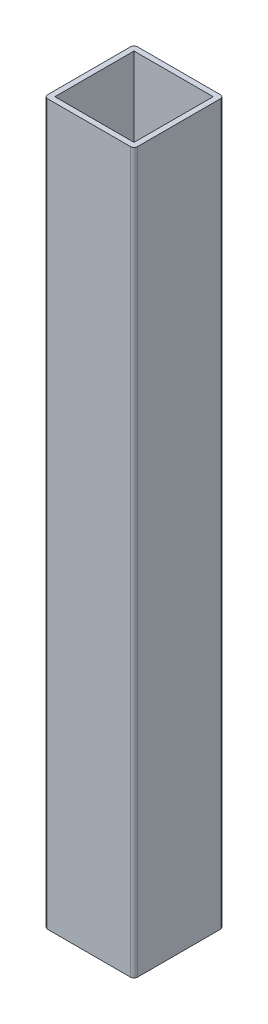
ISO-10303-21;
HEADER;
FILE_DESCRIPTION(('STEP AP214'),'2;1');
FILE_NAME('part.step','',(''),(''),'','','');
FILE_SCHEMA(('AUTOMOTIVE_DESIGN { 1 0 10303 214 1 1 1 1 }'));
ENDSEC;
DATA;
#1=APPLICATION_CONTEXT('core data for automotive mechanical design processes');
#2=APPLICATION_PROTOCOL_DEFINITION('international standard','automotive_design',2000,#1);
#3=PRODUCT_CONTEXT('',#1,'mechanical');
#4=PRODUCT('Part','Part','',(#3));
#5=PRODUCT_RELATED_PRODUCT_CATEGORY('part','',(#4));
#6=PRODUCT_DEFINITION_FORMATION('','',#4);
#7=PRODUCT_DEFINITION_CONTEXT('part definition',#1,'design');
#8=PRODUCT_DEFINITION('design','',#6,#7);
#9=PRODUCT_DEFINITION_SHAPE('','',#8);
#10=(LENGTH_UNIT() NAMED_UNIT(*) SI_UNIT(.MILLI.,.METRE.));
#11=(NAMED_UNIT(*) PLANE_ANGLE_UNIT() SI_UNIT($,.RADIAN.));
#12=(NAMED_UNIT(*) SI_UNIT($,.STERADIAN.) SOLID_ANGLE_UNIT());
#13=UNCERTAINTY_MEASURE_WITH_UNIT(LENGTH_MEASURE(1.E-05),#10,'distance_accuracy_value','');
#14=(GEOMETRIC_REPRESENTATION_CONTEXT(3) GLOBAL_UNCERTAINTY_ASSIGNED_CONTEXT((#13)) GLOBAL_UNIT_ASSIGNED_CONTEXT((#10,
#11,#12)) REPRESENTATION_CONTEXT('',''));
#15=CARTESIAN_POINT('',(0.,0.,0.));
#16=DIRECTION('',(0.,0.,1.));
#17=DIRECTION('',(1.,0.,0.));
#18=AXIS2_PLACEMENT_3D('',#15,#16,#17);
#19=CARTESIAN_POINT('',(2.,400.,-2.));
#20=DIRECTION('',(0.,-1.,0.));
#21=DIRECTION('',(0.,0.,-1.));
#22=AXIS2_PLACEMENT_3D('',#19,#20,#21);
#23=PLANE('',#22);
#24=CARTESIAN_POINT('',(2.,400.,-2.));
#25=DIRECTION('',(0.,1.,0.));
#26=DIRECTION('',(0.,0.,-1.));
#27=AXIS2_PLACEMENT_3D('',#24,#25,#26);
#28=CIRCLE('',#27,2.);
#29=CARTESIAN_POINT('',(0.,400.,-2.00000000000001));
#30=VERTEX_POINT('',#29);
#31=CARTESIAN_POINT('',(2.00000000000001,400.,0.));
#32=VERTEX_POINT('',#31);
#33=EDGE_CURVE('E181',#30,#32,#28,.T.);
#34=ORIENTED_EDGE('',*,*,#33,.T.);
#35=DIRECTION('',(1.,0.,0.));
#36=VECTOR('',#35,1.);
#37=CARTESIAN_POINT('',(2.00000000000001,400.,0.));
#38=LINE('',#37,#36);
#39=CARTESIAN_POINT('',(48.,400.,0.));
#40=VERTEX_POINT('',#39);
#41=EDGE_CURVE('E185',#32,#40,#38,.T.);
#42=ORIENTED_EDGE('',*,*,#41,.T.);
#43=CARTESIAN_POINT('',(48.,400.,-2.));
#44=DIRECTION('',(0.,1.,0.));
#45=DIRECTION('',(0.,0.,1.));
#46=AXIS2_PLACEMENT_3D('',#43,#44,#45);
#47=CIRCLE('',#46,2.);
#48=CARTESIAN_POINT('',(50.,400.,-2.00000000000001));
#49=VERTEX_POINT('',#48);
#50=EDGE_CURVE('E189',#40,#49,#47,.T.);
#51=ORIENTED_EDGE('',*,*,#50,.T.);
#52=DIRECTION('',(0.,0.,-1.));
#53=VECTOR('',#52,1.);
#54=CARTESIAN_POINT('',(50.,400.,-2.00000000000001));
#55=LINE('',#54,#53);
#56=CARTESIAN_POINT('',(50.,400.,-48.));
#57=VERTEX_POINT('',#56);
#58=EDGE_CURVE('E192',#49,#57,#55,.T.);
#59=ORIENTED_EDGE('',*,*,#58,.T.);
#60=CARTESIAN_POINT('',(48.,400.,-48.));
#61=DIRECTION('',(0.,1.,0.));
#62=DIRECTION('',(0.,0.,-1.));
#63=AXIS2_PLACEMENT_3D('',#60,#61,#62);
#64=CIRCLE('',#63,2.);
#65=CARTESIAN_POINT('',(48.,400.,-50.));
#66=VERTEX_POINT('',#65);
#67=EDGE_CURVE('E195',#57,#66,#64,.T.);
#68=ORIENTED_EDGE('',*,*,#67,.T.);
#69=DIRECTION('',(-1.,0.,0.));
#70=VECTOR('',#69,1.);
#71=CARTESIAN_POINT('',(2.00000000000001,400.,-50.));
#72=LINE('',#71,#70);
#73=CARTESIAN_POINT('',(2.00000000000001,400.,-50.));
#74=VERTEX_POINT('',#73);
#75=EDGE_CURVE('E198',#66,#74,#72,.T.);
#76=ORIENTED_EDGE('',*,*,#75,.T.);
#77=CARTESIAN_POINT('',(2.,400.,-48.));
#78=DIRECTION('',(0.,1.,0.));
#79=DIRECTION('',(0.,0.,-1.));
#80=AXIS2_PLACEMENT_3D('',#77,#78,#79);
#81=CIRCLE('',#80,2.);
#82=CARTESIAN_POINT('',(0.,400.,-48.));
#83=VERTEX_POINT('',#82);
#84=EDGE_CURVE('E201',#74,#83,#81,.T.);
#85=ORIENTED_EDGE('',*,*,#84,.T.);
#86=DIRECTION('',(0.,0.,1.));
#87=VECTOR('',#86,1.);
#88=CARTESIAN_POINT('',(0.,400.,-2.00000000000001));
#89=LINE('',#88,#87);
#90=EDGE_CURVE('E204',#83,#30,#89,.T.);
#91=ORIENTED_EDGE('',*,*,#90,.T.);
#92=EDGE_LOOP('',(#34,#42,#51,#59,#68,#76,#85,#91));
#93=FACE_BOUND('',#92,.T.);
#94=DIRECTION('',(0.,0.,1.));
#95=VECTOR('',#94,1.);
#96=CARTESIAN_POINT('',(3.,400.,-3.));
#97=LINE('',#96,#95);
#98=CARTESIAN_POINT('',(3.,400.,-47.));
#99=VERTEX_POINT('',#98);
#100=CARTESIAN_POINT('',(3.,400.,-3.));
#101=VERTEX_POINT('',#100);
#102=EDGE_CURVE('E133',#99,#101,#97,.T.);
#103=ORIENTED_EDGE('',*,*,#102,.F.);
#104=DIRECTION('',(-1.,0.,0.));
#105=VECTOR('',#104,1.);
#106=CARTESIAN_POINT('',(3.,400.,-47.));
#107=LINE('',#106,#105);
#108=CARTESIAN_POINT('',(47.,400.,-47.));
#109=VERTEX_POINT('',#108);
#110=EDGE_CURVE('E159',#109,#99,#107,.T.);
#111=ORIENTED_EDGE('',*,*,#110,.F.);
#112=DIRECTION('',(0.,0.,-1.));
#113=VECTOR('',#112,1.);
#114=CARTESIAN_POINT('',(47.,400.,-3.));
#115=LINE('',#114,#113);
#116=CARTESIAN_POINT('',(47.,400.,-3.));
#117=VERTEX_POINT('',#116);
#118=EDGE_CURVE('E155',#117,#109,#115,.T.);
#119=ORIENTED_EDGE('',*,*,#118,.F.);
#120=DIRECTION('',(1.,0.,0.));
#121=VECTOR('',#120,1.);
#122=CARTESIAN_POINT('',(3.,400.,-3.));
#123=LINE('',#122,#121);
#124=EDGE_CURVE('E142',#101,#117,#123,.T.);
#125=ORIENTED_EDGE('',*,*,#124,.F.);
#126=EDGE_LOOP('',(#103,#111,#119,#125));
#127=FACE_BOUND('',#126,.T.);
#128=ADVANCED_FACE('F43',(#93,#127),#23,.F.);
#129=CARTESIAN_POINT('',(2.,0.,-2.));
#130=DIRECTION('',(0.,-1.,0.));
#131=DIRECTION('',(0.,0.,-1.));
#132=AXIS2_PLACEMENT_3D('',#129,#130,#131);
#133=PLANE('',#132);
#134=CARTESIAN_POINT('',(2.,0.,-2.));
#135=DIRECTION('',(0.,1.,0.));
#136=DIRECTION('',(0.,0.,-1.));
#137=AXIS2_PLACEMENT_3D('',#134,#135,#136);
#138=CIRCLE('',#137,2.);
#139=CARTESIAN_POINT('',(0.,0.,-2.00000000000001));
#140=VERTEX_POINT('',#139);
#141=CARTESIAN_POINT('',(2.00000000000001,0.,0.));
#142=VERTEX_POINT('',#141);
#143=EDGE_CURVE('E151',#140,#142,#138,.T.);
#144=ORIENTED_EDGE('',*,*,#143,.F.);
#145=DIRECTION('',(0.,0.,1.));
#146=VECTOR('',#145,1.);
#147=CARTESIAN_POINT('',(0.,0.,-2.00000000000001));
#148=LINE('',#147,#146);
#149=CARTESIAN_POINT('',(0.,0.,-48.));
#150=VERTEX_POINT('',#149);
#151=EDGE_CURVE('E186',#150,#140,#148,.T.);
#152=ORIENTED_EDGE('',*,*,#151,.F.);
#153=CARTESIAN_POINT('',(2.,0.,-48.));
#154=DIRECTION('',(0.,1.,0.));
#155=DIRECTION('',(0.,0.,-1.));
#156=AXIS2_PLACEMENT_3D('',#153,#154,#155);
#157=CIRCLE('',#156,2.);
#158=CARTESIAN_POINT('',(2.00000000000001,0.,-50.));
#159=VERTEX_POINT('',#158);
#160=EDGE_CURVE('E226',#159,#150,#157,.T.);
#161=ORIENTED_EDGE('',*,*,#160,.F.);
#162=DIRECTION('',(-1.,0.,0.));
#163=VECTOR('',#162,1.);
#164=CARTESIAN_POINT('',(2.00000000000001,0.,-50.));
#165=LINE('',#164,#163);
#166=CARTESIAN_POINT('',(48.,0.,-50.));
#167=VERTEX_POINT('',#166);
#168=EDGE_CURVE('E223',#167,#159,#165,.T.);
#169=ORIENTED_EDGE('',*,*,#168,.F.);
#170=CARTESIAN_POINT('',(48.,0.,-48.));
#171=DIRECTION('',(0.,1.,0.));
#172=DIRECTION('',(0.,0.,-1.));
#173=AXIS2_PLACEMENT_3D('',#170,#171,#172);
#174=CIRCLE('',#173,2.);
#175=CARTESIAN_POINT('',(50.,0.,-48.));
#176=VERTEX_POINT('',#175);
#177=EDGE_CURVE('E220',#176,#167,#174,.T.);
#178=ORIENTED_EDGE('',*,*,#177,.F.);
#179=DIRECTION('',(0.,0.,-1.));
#180=VECTOR('',#179,1.);
#181=CARTESIAN_POINT('',(50.,0.,-2.00000000000001));
#182=LINE('',#181,#180);
#183=CARTESIAN_POINT('',(50.,0.,-2.00000000000001));
#184=VERTEX_POINT('',#183);
#185=EDGE_CURVE('E217',#184,#176,#182,.T.);
#186=ORIENTED_EDGE('',*,*,#185,.F.);
#187=CARTESIAN_POINT('',(48.,0.,-2.));
#188=DIRECTION('',(0.,1.,0.));
#189=DIRECTION('',(0.,0.,1.));
#190=AXIS2_PLACEMENT_3D('',#187,#188,#189);
#191=CIRCLE('',#190,2.);
#192=CARTESIAN_POINT('',(48.,0.,0.));
#193=VERTEX_POINT('',#192);
#194=EDGE_CURVE('E214',#193,#184,#191,.T.);
#195=ORIENTED_EDGE('',*,*,#194,.F.);
#196=DIRECTION('',(1.,0.,0.));
#197=VECTOR('',#196,1.);
#198=CARTESIAN_POINT('',(2.00000000000001,0.,0.));
#199=LINE('',#198,#197);
#200=EDGE_CURVE('E211',#142,#193,#199,.T.);
#201=ORIENTED_EDGE('',*,*,#200,.F.);
#202=EDGE_LOOP('',(#144,#152,#161,#169,#178,#186,#195,#201));
#203=FACE_BOUND('',#202,.T.);
#204=DIRECTION('',(-1.,0.,0.));
#205=VECTOR('',#204,1.);
#206=CARTESIAN_POINT('',(3.,0.,-47.));
#207=LINE('',#206,#205);
#208=CARTESIAN_POINT('',(47.,0.,-47.));
#209=VERTEX_POINT('',#208);
#210=CARTESIAN_POINT('',(3.,0.,-47.));
#211=VERTEX_POINT('',#210);
#212=EDGE_CURVE('E143',#209,#211,#207,.T.);
#213=ORIENTED_EDGE('',*,*,#212,.T.);
#214=DIRECTION('',(0.,0.,1.));
#215=VECTOR('',#214,1.);
#216=CARTESIAN_POINT('',(3.,0.,-3.));
#217=LINE('',#216,#215);
#218=CARTESIAN_POINT('',(3.,0.,-3.));
#219=VERTEX_POINT('',#218);
#220=EDGE_CURVE('E67',#211,#219,#217,.T.);
#221=ORIENTED_EDGE('',*,*,#220,.T.);
#222=DIRECTION('',(1.,0.,0.));
#223=VECTOR('',#222,1.);
#224=CARTESIAN_POINT('',(3.,0.,-3.));
#225=LINE('',#224,#223);
#226=CARTESIAN_POINT('',(47.,0.,-3.));
#227=VERTEX_POINT('',#226);
#228=EDGE_CURVE('E149',#219,#227,#225,.T.);
#229=ORIENTED_EDGE('',*,*,#228,.T.);
#230=DIRECTION('',(0.,0.,-1.));
#231=VECTOR('',#230,1.);
#232=CARTESIAN_POINT('',(47.,0.,-3.));
#233=LINE('',#232,#231);
#234=EDGE_CURVE('E168',#227,#209,#233,.T.);
#235=ORIENTED_EDGE('',*,*,#234,.T.);
#236=EDGE_LOOP('',(#213,#221,#229,#235));
#237=FACE_BOUND('',#236,.T.);
#238=ADVANCED_FACE('F265',(#203,#237),#133,.T.);
#239=CARTESIAN_POINT('',(2.,400.,-2.));
#240=DIRECTION('',(0.,-1.,0.));
#241=DIRECTION('',(0.,0.,-1.));
#242=AXIS2_PLACEMENT_3D('',#239,#240,#241);
#243=CYLINDRICAL_SURFACE('',#242,2.);
#244=ORIENTED_EDGE('',*,*,#143,.T.);
#245=DIRECTION('',(0.,-1.,0.));
#246=VECTOR('',#245,1.);
#247=CARTESIAN_POINT('',(2.00000000000001,400.,0.));
#248=LINE('',#247,#246);
#249=EDGE_CURVE('E11',#32,#142,#248,.T.);
#250=ORIENTED_EDGE('',*,*,#249,.F.);
#251=ORIENTED_EDGE('',*,*,#33,.F.);
#252=DIRECTION('',(0.,-1.,0.));
#253=VECTOR('',#252,1.);
#254=CARTESIAN_POINT('',(0.,400.,-2.00000000000001));
#255=LINE('',#254,#253);
#256=EDGE_CURVE('E207',#30,#140,#255,.T.);
#257=ORIENTED_EDGE('',*,*,#256,.T.);
#258=EDGE_LOOP('',(#244,#250,#251,#257));
#259=FACE_BOUND('',#258,.T.);
#260=ADVANCED_FACE('F45',(#259),#243,.T.);
#261=CARTESIAN_POINT('',(2.00000000000001,400.,0.));
#262=DIRECTION('',(0.,0.,-1.));
#263=DIRECTION('',(-1.,0.,0.));
#264=AXIS2_PLACEMENT_3D('',#261,#262,#263);
#265=PLANE('',#264);
#266=ORIENTED_EDGE('',*,*,#200,.T.);
#267=DIRECTION('',(0.,-1.,0.));
#268=VECTOR('',#267,1.);
#269=CARTESIAN_POINT('',(48.,400.,0.));
#270=LINE('',#269,#268);
#271=EDGE_CURVE('E52',#40,#193,#270,.T.);
#272=ORIENTED_EDGE('',*,*,#271,.F.);
#273=ORIENTED_EDGE('',*,*,#41,.F.);
#274=ORIENTED_EDGE('',*,*,#249,.T.);
#275=EDGE_LOOP('',(#266,#272,#273,#274));
#276=FACE_BOUND('',#275,.T.);
#277=ADVANCED_FACE('F282',(#276),#265,.F.);
#278=CARTESIAN_POINT('',(48.,400.,-2.));
#279=DIRECTION('',(0.,-1.,0.));
#280=DIRECTION('',(0.,0.,-1.));
#281=AXIS2_PLACEMENT_3D('',#278,#279,#280);
#282=CYLINDRICAL_SURFACE('',#281,2.);
#283=ORIENTED_EDGE('',*,*,#194,.T.);
#284=DIRECTION('',(0.,-1.,0.));
#285=VECTOR('',#284,1.);
#286=CARTESIAN_POINT('',(50.,400.,-2.00000000000001));
#287=LINE('',#286,#285);
#288=EDGE_CURVE('E250',#49,#184,#287,.T.);
#289=ORIENTED_EDGE('',*,*,#288,.F.);
#290=ORIENTED_EDGE('',*,*,#50,.F.);
#291=ORIENTED_EDGE('',*,*,#271,.T.);
#292=EDGE_LOOP('',(#283,#289,#290,#291));
#293=FACE_BOUND('',#292,.T.);
#294=ADVANCED_FACE('F259',(#293),#282,.T.);
#295=CARTESIAN_POINT('',(50.,400.,-2.00000000000001));
#296=DIRECTION('',(-1.,0.,0.));
#297=DIRECTION('',(0.,0.,1.));
#298=AXIS2_PLACEMENT_3D('',#295,#296,#297);
#299=PLANE('',#298);
#300=ORIENTED_EDGE('',*,*,#185,.T.);
#301=DIRECTION('',(0.,-1.,0.));
#302=VECTOR('',#301,1.);
#303=CARTESIAN_POINT('',(50.,400.,-48.));
#304=LINE('',#303,#302);
#305=EDGE_CURVE('E246',#57,#176,#304,.T.);
#306=ORIENTED_EDGE('',*,*,#305,.F.);
#307=ORIENTED_EDGE('',*,*,#58,.F.);
#308=ORIENTED_EDGE('',*,*,#288,.T.);
#309=EDGE_LOOP('',(#300,#306,#307,#308));
#310=FACE_BOUND('',#309,.T.);
#311=ADVANCED_FACE('F271',(#310),#299,.F.);
#312=CARTESIAN_POINT('',(48.,400.,-48.));
#313=DIRECTION('',(0.,-1.,0.));
#314=DIRECTION('',(0.,0.,-1.));
#315=AXIS2_PLACEMENT_3D('',#312,#313,#314);
#316=CYLINDRICAL_SURFACE('',#315,2.);
#317=ORIENTED_EDGE('',*,*,#177,.T.);
#318=DIRECTION('',(0.,-1.,0.));
#319=VECTOR('',#318,1.);
#320=CARTESIAN_POINT('',(48.,400.,-50.));
#321=LINE('',#320,#319);
#322=EDGE_CURVE('E242',#66,#167,#321,.T.);
#323=ORIENTED_EDGE('',*,*,#322,.F.);
#324=ORIENTED_EDGE('',*,*,#67,.F.);
#325=ORIENTED_EDGE('',*,*,#305,.T.);
#326=EDGE_LOOP('',(#317,#323,#324,#325));
#327=FACE_BOUND('',#326,.T.);
#328=ADVANCED_FACE('F275',(#327),#316,.T.);
#329=CARTESIAN_POINT('',(2.00000000000001,400.,-50.));
#330=DIRECTION('',(0.,0.,1.));
#331=DIRECTION('',(1.,0.,0.));
#332=AXIS2_PLACEMENT_3D('',#329,#330,#331);
#333=PLANE('',#332);
#334=ORIENTED_EDGE('',*,*,#168,.T.);
#335=DIRECTION('',(0.,-1.,0.));
#336=VECTOR('',#335,1.);
#337=CARTESIAN_POINT('',(2.00000000000001,400.,-50.));
#338=LINE('',#337,#336);
#339=EDGE_CURVE('E238',#74,#159,#338,.T.);
#340=ORIENTED_EDGE('',*,*,#339,.F.);
#341=ORIENTED_EDGE('',*,*,#75,.F.);
#342=ORIENTED_EDGE('',*,*,#322,.T.);
#343=EDGE_LOOP('',(#334,#340,#341,#342));
#344=FACE_BOUND('',#343,.T.);
#345=ADVANCED_FACE('F295',(#344),#333,.F.);
#346=CARTESIAN_POINT('',(2.,400.,-48.));
#347=DIRECTION('',(0.,-1.,0.));
#348=DIRECTION('',(0.,0.,-1.));
#349=AXIS2_PLACEMENT_3D('',#346,#347,#348);
#350=CYLINDRICAL_SURFACE('',#349,2.);
#351=ORIENTED_EDGE('',*,*,#160,.T.);
#352=DIRECTION('',(0.,-1.,0.));
#353=VECTOR('',#352,1.);
#354=CARTESIAN_POINT('',(0.,400.,-48.));
#355=LINE('',#354,#353);
#356=EDGE_CURVE('E234',#83,#150,#355,.T.);
#357=ORIENTED_EDGE('',*,*,#356,.F.);
#358=ORIENTED_EDGE('',*,*,#84,.F.);
#359=ORIENTED_EDGE('',*,*,#339,.T.);
#360=EDGE_LOOP('',(#351,#357,#358,#359));
#361=FACE_BOUND('',#360,.T.);
#362=ADVANCED_FACE('F293',(#361),#350,.T.);
#363=CARTESIAN_POINT('',(0.,400.,-2.00000000000001));
#364=DIRECTION('',(1.,0.,0.));
#365=DIRECTION('',(0.,0.,-1.));
#366=AXIS2_PLACEMENT_3D('',#363,#364,#365);
#367=PLANE('',#366);
#368=ORIENTED_EDGE('',*,*,#151,.T.);
#369=ORIENTED_EDGE('',*,*,#256,.F.);
#370=ORIENTED_EDGE('',*,*,#90,.F.);
#371=ORIENTED_EDGE('',*,*,#356,.T.);
#372=EDGE_LOOP('',(#368,#369,#370,#371));
#373=FACE_BOUND('',#372,.T.);
#374=ADVANCED_FACE('F288',(#373),#367,.F.);
#375=CARTESIAN_POINT('',(3.,400.,-3.));
#376=DIRECTION('',(1.,0.,0.));
#377=DIRECTION('',(0.,0.,-1.));
#378=AXIS2_PLACEMENT_3D('',#375,#376,#377);
#379=PLANE('',#378);
#380=ORIENTED_EDGE('',*,*,#220,.F.);
#381=DIRECTION('',(0.,-1.,0.));
#382=VECTOR('',#381,1.);
#383=CARTESIAN_POINT('',(3.,400.,-47.));
#384=LINE('',#383,#382);
#385=EDGE_CURVE('E137',#99,#211,#384,.T.);
#386=ORIENTED_EDGE('',*,*,#385,.F.);
#387=ORIENTED_EDGE('',*,*,#102,.T.);
#388=DIRECTION('',(0.,-1.,0.));
#389=VECTOR('',#388,1.);
#390=CARTESIAN_POINT('',(3.,400.,-3.));
#391=LINE('',#390,#389);
#392=EDGE_CURVE('E136',#101,#219,#391,.T.);
#393=ORIENTED_EDGE('',*,*,#392,.T.);
#394=EDGE_LOOP('',(#380,#386,#387,#393));
#395=FACE_BOUND('',#394,.T.);
#396=ADVANCED_FACE('F135',(#395),#379,.T.);
#397=CARTESIAN_POINT('',(3.,400.,-3.));
#398=DIRECTION('',(0.,0.,-1.));
#399=DIRECTION('',(-1.,0.,0.));
#400=AXIS2_PLACEMENT_3D('',#397,#398,#399);
#401=PLANE('',#400);
#402=ORIENTED_EDGE('',*,*,#228,.F.);
#403=ORIENTED_EDGE('',*,*,#392,.F.);
#404=ORIENTED_EDGE('',*,*,#124,.T.);
#405=DIRECTION('',(0.,-1.,0.));
#406=VECTOR('',#405,1.);
#407=CARTESIAN_POINT('',(47.,400.,-3.));
#408=LINE('',#407,#406);
#409=EDGE_CURVE('E152',#117,#227,#408,.T.);
#410=ORIENTED_EDGE('',*,*,#409,.T.);
#411=EDGE_LOOP('',(#402,#403,#404,#410));
#412=FACE_BOUND('',#411,.T.);
#413=ADVANCED_FACE('F146',(#412),#401,.T.);
#414=CARTESIAN_POINT('',(47.,400.,-3.));
#415=DIRECTION('',(-1.,0.,0.));
#416=DIRECTION('',(0.,0.,1.));
#417=AXIS2_PLACEMENT_3D('',#414,#415,#416);
#418=PLANE('',#417);
#419=ORIENTED_EDGE('',*,*,#234,.F.);
#420=ORIENTED_EDGE('',*,*,#409,.F.);
#421=ORIENTED_EDGE('',*,*,#118,.T.);
#422=DIRECTION('',(0.,-1.,0.));
#423=VECTOR('',#422,1.);
#424=CARTESIAN_POINT('',(47.,400.,-47.));
#425=LINE('',#424,#423);
#426=EDGE_CURVE('E59',#109,#209,#425,.T.);
#427=ORIENTED_EDGE('',*,*,#426,.T.);
#428=EDGE_LOOP('',(#419,#420,#421,#427));
#429=FACE_BOUND('',#428,.T.);
#430=ADVANCED_FACE('F320',(#429),#418,.T.);
#431=CARTESIAN_POINT('',(3.,400.,-47.));
#432=DIRECTION('',(0.,0.,1.));
#433=DIRECTION('',(1.,0.,0.));
#434=AXIS2_PLACEMENT_3D('',#431,#432,#433);
#435=PLANE('',#434);
#436=ORIENTED_EDGE('',*,*,#212,.F.);
#437=ORIENTED_EDGE('',*,*,#426,.F.);
#438=ORIENTED_EDGE('',*,*,#110,.T.);
#439=ORIENTED_EDGE('',*,*,#385,.T.);
#440=EDGE_LOOP('',(#436,#437,#438,#439));
#441=FACE_BOUND('',#440,.T.);
#442=ADVANCED_FACE('F324',(#441),#435,.T.);
#443=CLOSED_SHELL('',(#128,#238,#260,#277,#294,#311,#328,#345,#362,#374,#396,#413,#430,#442));
#444=MANIFOLD_SOLID_BREP('B2',#443);
#445=ADVANCED_BREP_SHAPE_REPRESENTATION('',(#18,#444),#14);
#446=SHAPE_DEFINITION_REPRESENTATION(#9,#445);
ENDSEC;
END-ISO-10303-21;
